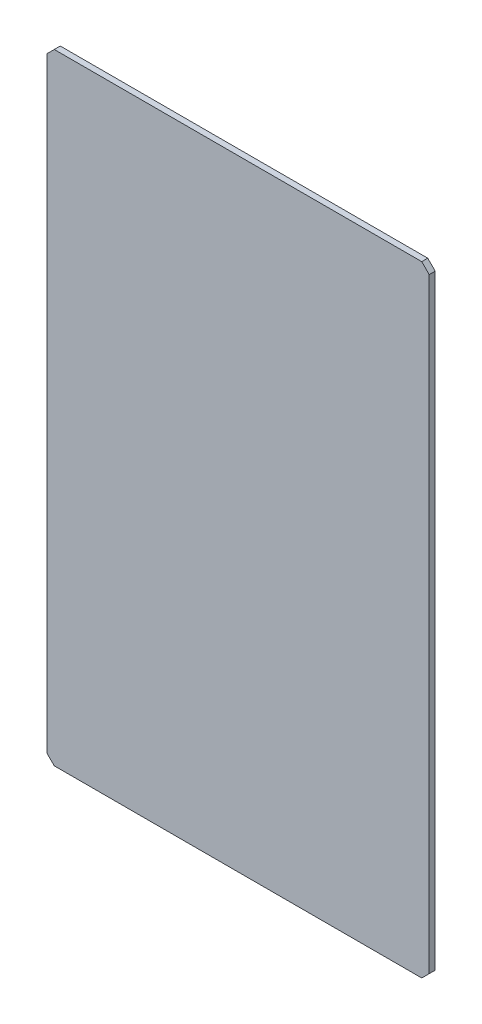
ISO-10303-21;
HEADER;
FILE_DESCRIPTION(('STEP AP214'),'2;1');
FILE_NAME('part.step','',(''),(''),'','','');
FILE_SCHEMA(('AUTOMOTIVE_DESIGN { 1 0 10303 214 1 1 1 1 }'));
ENDSEC;
DATA;
#1=APPLICATION_CONTEXT('core data for automotive mechanical design processes');
#2=APPLICATION_PROTOCOL_DEFINITION('international standard','automotive_design',2000,#1);
#3=PRODUCT_CONTEXT('',#1,'mechanical');
#4=PRODUCT('Part','Part','',(#3));
#5=PRODUCT_RELATED_PRODUCT_CATEGORY('part','',(#4));
#6=PRODUCT_DEFINITION_FORMATION('','',#4);
#7=PRODUCT_DEFINITION_CONTEXT('part definition',#1,'design');
#8=PRODUCT_DEFINITION('design','',#6,#7);
#9=PRODUCT_DEFINITION_SHAPE('','',#8);
#10=(LENGTH_UNIT() NAMED_UNIT(*) SI_UNIT(.MILLI.,.METRE.));
#11=(NAMED_UNIT(*) PLANE_ANGLE_UNIT() SI_UNIT($,.RADIAN.));
#12=(NAMED_UNIT(*) SI_UNIT($,.STERADIAN.) SOLID_ANGLE_UNIT());
#13=UNCERTAINTY_MEASURE_WITH_UNIT(LENGTH_MEASURE(1.E-05),#10,'distance_accuracy_value','');
#14=(GEOMETRIC_REPRESENTATION_CONTEXT(3) GLOBAL_UNCERTAINTY_ASSIGNED_CONTEXT((#13)) GLOBAL_UNIT_ASSIGNED_CONTEXT((#10,
#11,#12)) REPRESENTATION_CONTEXT('',''));
#15=CARTESIAN_POINT('',(0.,0.,0.));
#16=DIRECTION('',(0.,0.,1.));
#17=DIRECTION('',(1.,0.,0.));
#18=AXIS2_PLACEMENT_3D('',#15,#16,#17);
#19=CARTESIAN_POINT('',(48.2004047680435,98.6730587688089,1.2));
#20=DIRECTION('',(-1.,0.,0.));
#21=DIRECTION('',(0.,-1.,0.));
#22=AXIS2_PLACEMENT_3D('',#19,#20,#21);
#23=PLANE('',#22);
#24=DIRECTION('',(0.,1.,0.));
#25=VECTOR('',#24,1.);
#26=CARTESIAN_POINT('',(48.2004047680435,98.6730587688089,0.));
#27=LINE('',#26,#25);
#28=CARTESIAN_POINT('',(48.2004047680435,-23.914429894717,0.));
#29=VERTEX_POINT('',#28);
#30=CARTESIAN_POINT('',(48.2004047680435,97.1730587688089,0.));
#31=VERTEX_POINT('',#30);
#32=EDGE_CURVE('E131',#29,#31,#27,.T.);
#33=ORIENTED_EDGE('',*,*,#32,.T.);
#34=DIRECTION('',(0.,0.,1.));
#35=VECTOR('',#34,1.);
#36=CARTESIAN_POINT('',(48.2004047680435,97.1730587688089,1.2));
#37=LINE('',#36,#35);
#38=CARTESIAN_POINT('',(48.2004047680435,97.1730587688089,1.2));
#39=VERTEX_POINT('',#38);
#40=EDGE_CURVE('E109',#31,#39,#37,.T.);
#41=ORIENTED_EDGE('',*,*,#40,.T.);
#42=DIRECTION('',(0.,1.,0.));
#43=VECTOR('',#42,1.);
#44=CARTESIAN_POINT('',(48.2004047680435,98.6730587688089,1.2));
#45=LINE('',#44,#43);
#46=CARTESIAN_POINT('',(48.2004047680435,-23.914429894717,1.2));
#47=VERTEX_POINT('',#46);
#48=EDGE_CURVE('E140',#47,#39,#45,.T.);
#49=ORIENTED_EDGE('',*,*,#48,.F.);
#50=DIRECTION('',(0.,0.,-1.));
#51=VECTOR('',#50,1.);
#52=CARTESIAN_POINT('',(48.2004047680435,-23.914429894717,1.2));
#53=LINE('',#52,#51);
#54=EDGE_CURVE('E114',#47,#29,#53,.T.);
#55=ORIENTED_EDGE('',*,*,#54,.T.);
#56=EDGE_LOOP('',(#33,#41,#49,#55));
#57=FACE_BOUND('',#56,.T.);
#58=ADVANCED_FACE('F37',(#57),#23,.F.);
#59=CARTESIAN_POINT('',(-28.2995952319565,98.6730587688089,1.2));
#60=DIRECTION('',(0.,-1.,0.));
#61=DIRECTION('',(0.,0.,-1.));
#62=AXIS2_PLACEMENT_3D('',#59,#60,#61);
#63=PLANE('',#62);
#64=DIRECTION('',(-1.,0.,0.));
#65=VECTOR('',#64,1.);
#66=CARTESIAN_POINT('',(-28.2995952319565,98.6730587688089,1.2));
#67=LINE('',#66,#65);
#68=CARTESIAN_POINT('',(46.7004047680435,98.6730587688089,1.2));
#69=VERTEX_POINT('',#68);
#70=CARTESIAN_POINT('',(-26.7995952319565,98.6730587688089,1.2));
#71=VERTEX_POINT('',#70);
#72=EDGE_CURVE('E124',#69,#71,#67,.T.);
#73=ORIENTED_EDGE('',*,*,#72,.F.);
#74=DIRECTION('',(0.,0.,-1.));
#75=VECTOR('',#74,1.);
#76=CARTESIAN_POINT('',(46.7004047680435,98.6730587688089,1.2));
#77=LINE('',#76,#75);
#78=CARTESIAN_POINT('',(46.7004047680435,98.6730587688089,0.));
#79=VERTEX_POINT('',#78);
#80=EDGE_CURVE('E108',#69,#79,#77,.T.);
#81=ORIENTED_EDGE('',*,*,#80,.T.);
#82=DIRECTION('',(-1.,0.,0.));
#83=VECTOR('',#82,1.);
#84=CARTESIAN_POINT('',(-28.2995952319565,98.6730587688089,0.));
#85=LINE('',#84,#83);
#86=CARTESIAN_POINT('',(-26.7995952319565,98.6730587688089,0.));
#87=VERTEX_POINT('',#86);
#88=EDGE_CURVE('E121',#79,#87,#85,.T.);
#89=ORIENTED_EDGE('',*,*,#88,.T.);
#90=DIRECTION('',(0.,0.,1.));
#91=VECTOR('',#90,1.);
#92=CARTESIAN_POINT('',(-26.7995952319565,98.6730587688089,1.2));
#93=LINE('',#92,#91);
#94=EDGE_CURVE('E126',#87,#71,#93,.T.);
#95=ORIENTED_EDGE('',*,*,#94,.T.);
#96=EDGE_LOOP('',(#73,#81,#89,#95));
#97=FACE_BOUND('',#96,.T.);
#98=ADVANCED_FACE('F120',(#97),#63,.F.);
#99=CARTESIAN_POINT('',(-28.2995952319565,98.6730587688089,1.2));
#100=DIRECTION('',(1.,0.,0.));
#101=DIRECTION('',(0.,1.,0.));
#102=AXIS2_PLACEMENT_3D('',#99,#100,#101);
#103=PLANE('',#102);
#104=DIRECTION('',(0.,-1.,0.));
#105=VECTOR('',#104,1.);
#106=CARTESIAN_POINT('',(-28.2995952319565,98.6730587688089,1.2));
#107=LINE('',#106,#105);
#108=CARTESIAN_POINT('',(-28.2995952319565,97.173058768809,1.2));
#109=VERTEX_POINT('',#108);
#110=CARTESIAN_POINT('',(-28.2995952319565,-23.914429894717,1.2));
#111=VERTEX_POINT('',#110);
#112=EDGE_CURVE('E166',#109,#111,#107,.T.);
#113=ORIENTED_EDGE('',*,*,#112,.F.);
#114=DIRECTION('',(0.,0.,-1.));
#115=VECTOR('',#114,1.);
#116=CARTESIAN_POINT('',(-28.2995952319565,97.173058768809,1.2));
#117=LINE('',#116,#115);
#118=CARTESIAN_POINT('',(-28.2995952319565,97.173058768809,0.));
#119=VERTEX_POINT('',#118);
#120=EDGE_CURVE('E159',#109,#119,#117,.T.);
#121=ORIENTED_EDGE('',*,*,#120,.T.);
#122=DIRECTION('',(0.,-1.,0.));
#123=VECTOR('',#122,1.);
#124=CARTESIAN_POINT('',(-28.2995952319565,98.6730587688089,0.));
#125=LINE('',#124,#123);
#126=CARTESIAN_POINT('',(-28.2995952319565,-23.914429894717,0.));
#127=VERTEX_POINT('',#126);
#128=EDGE_CURVE('E130',#119,#127,#125,.T.);
#129=ORIENTED_EDGE('',*,*,#128,.T.);
#130=DIRECTION('',(0.,0.,1.));
#131=VECTOR('',#130,1.);
#132=CARTESIAN_POINT('',(-28.2995952319565,-23.914429894717,1.2));
#133=LINE('',#132,#131);
#134=EDGE_CURVE('E157',#127,#111,#133,.T.);
#135=ORIENTED_EDGE('',*,*,#134,.T.);
#136=EDGE_LOOP('',(#113,#121,#129,#135));
#137=FACE_BOUND('',#136,.T.);
#138=ADVANCED_FACE('F164',(#137),#103,.F.);
#139=CARTESIAN_POINT('',(-28.2995952319565,-25.414429894717,1.2));
#140=DIRECTION('',(0.,1.,0.));
#141=DIRECTION('',(0.,0.,1.));
#142=AXIS2_PLACEMENT_3D('',#139,#140,#141);
#143=PLANE('',#142);
#144=DIRECTION('',(1.,0.,0.));
#145=VECTOR('',#144,1.);
#146=CARTESIAN_POINT('',(-28.2995952319565,-25.414429894717,1.2));
#147=LINE('',#146,#145);
#148=CARTESIAN_POINT('',(-26.7995952319565,-25.414429894717,1.2));
#149=VERTEX_POINT('',#148);
#150=CARTESIAN_POINT('',(46.7004047680435,-25.414429894717,1.2));
#151=VERTEX_POINT('',#150);
#152=EDGE_CURVE('E141',#149,#151,#147,.T.);
#153=ORIENTED_EDGE('',*,*,#152,.F.);
#154=DIRECTION('',(0.,0.,-1.));
#155=VECTOR('',#154,1.);
#156=CARTESIAN_POINT('',(-26.7995952319565,-25.414429894717,1.2));
#157=LINE('',#156,#155);
#158=CARTESIAN_POINT('',(-26.7995952319565,-25.414429894717,0.));
#159=VERTEX_POINT('',#158);
#160=EDGE_CURVE('E11',#149,#159,#157,.T.);
#161=ORIENTED_EDGE('',*,*,#160,.T.);
#162=DIRECTION('',(1.,0.,0.));
#163=VECTOR('',#162,1.);
#164=CARTESIAN_POINT('',(-28.2995952319565,-25.414429894717,0.));
#165=LINE('',#164,#163);
#166=CARTESIAN_POINT('',(46.7004047680435,-25.414429894717,0.));
#167=VERTEX_POINT('',#166);
#168=EDGE_CURVE('E134',#159,#167,#165,.T.);
#169=ORIENTED_EDGE('',*,*,#168,.T.);
#170=DIRECTION('',(0.,0.,1.));
#171=VECTOR('',#170,1.);
#172=CARTESIAN_POINT('',(46.7004047680435,-25.414429894717,1.2));
#173=LINE('',#172,#171);
#174=EDGE_CURVE('E46',#167,#151,#173,.T.);
#175=ORIENTED_EDGE('',*,*,#174,.T.);
#176=EDGE_LOOP('',(#153,#161,#169,#175));
#177=FACE_BOUND('',#176,.T.);
#178=ADVANCED_FACE('F173',(#177),#143,.F.);
#179=CARTESIAN_POINT('',(0.,0.,1.2));
#180=DIRECTION('',(0.,0.,1.));
#181=DIRECTION('',(1.,0.,0.));
#182=AXIS2_PLACEMENT_3D('',#179,#180,#181);
#183=PLANE('',#182);
#184=ORIENTED_EDGE('',*,*,#48,.T.);
#185=DIRECTION('',(0.707106781186548,-0.707106781186548,0.));
#186=VECTOR('',#185,1.);
#187=CARTESIAN_POINT('',(72.6867317684262,72.6867317684262,1.2));
#188=LINE('',#187,#186);
#189=EDGE_CURVE('E155',#39,#69,#188,.F.);
#190=ORIENTED_EDGE('',*,*,#189,.T.);
#191=ORIENTED_EDGE('',*,*,#72,.T.);
#192=DIRECTION('',(0.707106781186548,0.707106781186548,0.));
#193=VECTOR('',#192,1.);
#194=CARTESIAN_POINT('',(-62.7363270003827,62.7363270003827,1.2));
#195=LINE('',#194,#193);
#196=EDGE_CURVE('E153',#71,#109,#195,.F.);
#197=ORIENTED_EDGE('',*,*,#196,.T.);
#198=ORIENTED_EDGE('',*,*,#112,.T.);
#199=DIRECTION('',(-0.707106781186544,0.707106781186551,0.));
#200=VECTOR('',#199,1.);
#201=CARTESIAN_POINT('',(-26.1070125633369,-26.1070125633366,1.2));
#202=LINE('',#201,#200);
#203=EDGE_CURVE('E59',#111,#149,#202,.F.);
#204=ORIENTED_EDGE('',*,*,#203,.T.);
#205=ORIENTED_EDGE('',*,*,#152,.T.);
#206=DIRECTION('',(-0.707106781186548,-0.707106781186548,0.));
#207=VECTOR('',#206,1.);
#208=CARTESIAN_POINT('',(36.0574173313802,-36.0574173313802,1.2));
#209=LINE('',#208,#207);
#210=EDGE_CURVE('E150',#151,#47,#209,.F.);
#211=ORIENTED_EDGE('',*,*,#210,.T.);
#212=EDGE_LOOP('',(#184,#190,#191,#197,#198,#204,#205,#211));
#213=FACE_BOUND('',#212,.T.);
#214=ADVANCED_FACE('F180',(#213),#183,.T.);
#215=CARTESIAN_POINT('',(0.,0.,0.));
#216=DIRECTION('',(0.,0.,1.));
#217=DIRECTION('',(1.,0.,0.));
#218=AXIS2_PLACEMENT_3D('',#215,#216,#217);
#219=PLANE('',#218);
#220=ORIENTED_EDGE('',*,*,#88,.F.);
#221=DIRECTION('',(-0.707106781186548,0.707106781186548,0.));
#222=VECTOR('',#221,1.);
#223=CARTESIAN_POINT('',(46.7004047680435,98.6730587688089,0.));
#224=LINE('',#223,#222);
#225=EDGE_CURVE('E104',#79,#31,#224,.F.);
#226=ORIENTED_EDGE('',*,*,#225,.T.);
#227=ORIENTED_EDGE('',*,*,#32,.F.);
#228=DIRECTION('',(0.707106781186548,0.707106781186548,0.));
#229=VECTOR('',#228,1.);
#230=CARTESIAN_POINT('',(48.2004047680435,-23.914429894717,0.));
#231=LINE('',#230,#229);
#232=EDGE_CURVE('E125',#29,#167,#231,.F.);
#233=ORIENTED_EDGE('',*,*,#232,.T.);
#234=ORIENTED_EDGE('',*,*,#168,.F.);
#235=DIRECTION('',(0.707106781186544,-0.707106781186551,0.));
#236=VECTOR('',#235,1.);
#237=CARTESIAN_POINT('',(-26.7995952319565,-25.414429894717,0.));
#238=LINE('',#237,#236);
#239=EDGE_CURVE('E144',#159,#127,#238,.F.);
#240=ORIENTED_EDGE('',*,*,#239,.T.);
#241=ORIENTED_EDGE('',*,*,#128,.F.);
#242=DIRECTION('',(-0.707106781186548,-0.707106781186548,0.));
#243=VECTOR('',#242,1.);
#244=CARTESIAN_POINT('',(-28.2995952319565,97.173058768809,0.));
#245=LINE('',#244,#243);
#246=EDGE_CURVE('E115',#119,#87,#245,.F.);
#247=ORIENTED_EDGE('',*,*,#246,.T.);
#248=EDGE_LOOP('',(#220,#226,#227,#233,#234,#240,#241,#247));
#249=FACE_BOUND('',#248,.T.);
#250=ADVANCED_FACE('F128',(#249),#219,.F.);
#251=CARTESIAN_POINT('',(46.7004047680435,98.6730587688089,1.2));
#252=DIRECTION('',(-0.707106781186547,-0.707106781186547,0.));
#253=DIRECTION('',(0.,0.,-1.));
#254=AXIS2_PLACEMENT_3D('',#251,#252,#253);
#255=PLANE('',#254);
#256=ORIENTED_EDGE('',*,*,#189,.F.);
#257=ORIENTED_EDGE('',*,*,#40,.F.);
#258=ORIENTED_EDGE('',*,*,#225,.F.);
#259=ORIENTED_EDGE('',*,*,#80,.F.);
#260=EDGE_LOOP('',(#256,#257,#258,#259));
#261=FACE_BOUND('',#260,.T.);
#262=ADVANCED_FACE('F107',(#261),#255,.F.);
#263=CARTESIAN_POINT('',(-28.2995952319565,97.173058768809,1.2));
#264=DIRECTION('',(0.707106781186548,-0.707106781186548,0.));
#265=DIRECTION('',(0.,0.,-1.));
#266=AXIS2_PLACEMENT_3D('',#263,#264,#265);
#267=PLANE('',#266);
#268=ORIENTED_EDGE('',*,*,#196,.F.);
#269=ORIENTED_EDGE('',*,*,#94,.F.);
#270=ORIENTED_EDGE('',*,*,#246,.F.);
#271=ORIENTED_EDGE('',*,*,#120,.F.);
#272=EDGE_LOOP('',(#268,#269,#270,#271));
#273=FACE_BOUND('',#272,.T.);
#274=ADVANCED_FACE('F188',(#273),#267,.F.);
#275=CARTESIAN_POINT('',(-26.7995952319565,-25.414429894717,1.2));
#276=DIRECTION('',(0.707106781186551,0.707106781186544,0.));
#277=DIRECTION('',(0.,0.,-1.));
#278=AXIS2_PLACEMENT_3D('',#275,#276,#277);
#279=PLANE('',#278);
#280=ORIENTED_EDGE('',*,*,#203,.F.);
#281=ORIENTED_EDGE('',*,*,#134,.F.);
#282=ORIENTED_EDGE('',*,*,#239,.F.);
#283=ORIENTED_EDGE('',*,*,#160,.F.);
#284=EDGE_LOOP('',(#280,#281,#282,#283));
#285=FACE_BOUND('',#284,.T.);
#286=ADVANCED_FACE('F172',(#285),#279,.F.);
#287=CARTESIAN_POINT('',(48.2004047680435,-23.914429894717,1.2));
#288=DIRECTION('',(-0.707106781186547,0.707106781186547,0.));
#289=DIRECTION('',(0.,0.,-1.));
#290=AXIS2_PLACEMENT_3D('',#287,#288,#289);
#291=PLANE('',#290);
#292=ORIENTED_EDGE('',*,*,#210,.F.);
#293=ORIENTED_EDGE('',*,*,#174,.F.);
#294=ORIENTED_EDGE('',*,*,#232,.F.);
#295=ORIENTED_EDGE('',*,*,#54,.F.);
#296=EDGE_LOOP('',(#292,#293,#294,#295));
#297=FACE_BOUND('',#296,.T.);
#298=ADVANCED_FACE('F40',(#297),#291,.F.);
#299=CLOSED_SHELL('',(#58,#98,#138,#178,#214,#250,#262,#274,#286,#298));
#300=MANIFOLD_SOLID_BREP('B2',#299);
#301=ADVANCED_BREP_SHAPE_REPRESENTATION('',(#18,#300),#14);
#302=SHAPE_DEFINITION_REPRESENTATION(#9,#301);
ENDSEC;
END-ISO-10303-21;
